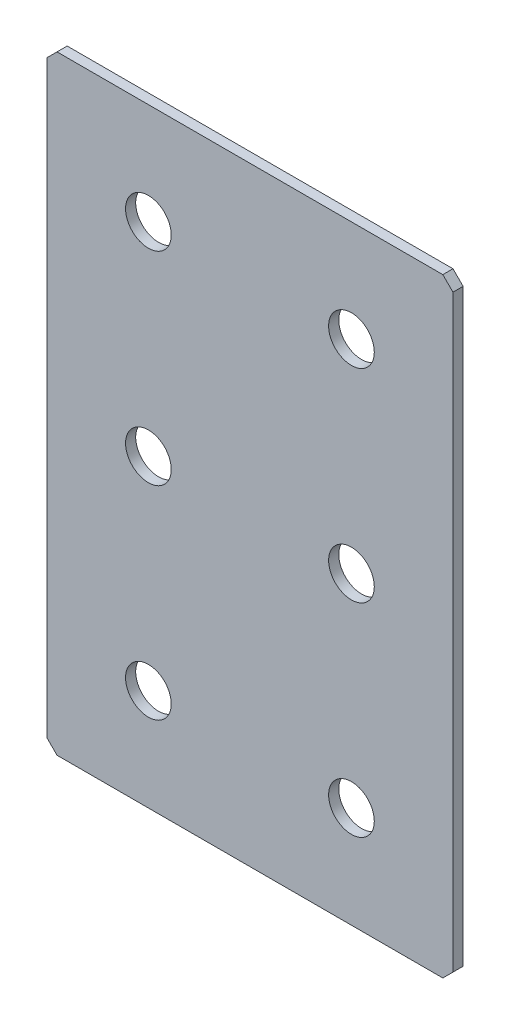
ISO-10303-21;
HEADER;
FILE_DESCRIPTION(('STEP AP214'),'2;1');
FILE_NAME('part.step','',(''),(''),'','','');
FILE_SCHEMA(('AUTOMOTIVE_DESIGN { 1 0 10303 214 1 1 1 1 }'));
ENDSEC;
DATA;
#1=APPLICATION_CONTEXT('core data for automotive mechanical design processes');
#2=APPLICATION_PROTOCOL_DEFINITION('international standard','automotive_design',2000,#1);
#3=PRODUCT_CONTEXT('',#1,'mechanical');
#4=PRODUCT('Part','Part','',(#3));
#5=PRODUCT_RELATED_PRODUCT_CATEGORY('part','',(#4));
#6=PRODUCT_DEFINITION_FORMATION('','',#4);
#7=PRODUCT_DEFINITION_CONTEXT('part definition',#1,'design');
#8=PRODUCT_DEFINITION('design','',#6,#7);
#9=PRODUCT_DEFINITION_SHAPE('','',#8);
#10=(LENGTH_UNIT() NAMED_UNIT(*) SI_UNIT(.MILLI.,.METRE.));
#11=(NAMED_UNIT(*) PLANE_ANGLE_UNIT() SI_UNIT($,.RADIAN.));
#12=(NAMED_UNIT(*) SI_UNIT($,.STERADIAN.) SOLID_ANGLE_UNIT());
#13=UNCERTAINTY_MEASURE_WITH_UNIT(LENGTH_MEASURE(1.E-05),#10,'distance_accuracy_value','');
#14=(GEOMETRIC_REPRESENTATION_CONTEXT(3) GLOBAL_UNCERTAINTY_ASSIGNED_CONTEXT((#13)) GLOBAL_UNIT_ASSIGNED_CONTEXT((#10,
#11,#12)) REPRESENTATION_CONTEXT('',''));
#15=CARTESIAN_POINT('',(0.,0.,0.));
#16=DIRECTION('',(0.,0.,1.));
#17=DIRECTION('',(1.,0.,0.));
#18=AXIS2_PLACEMENT_3D('',#15,#16,#17);
#19=CARTESIAN_POINT('',(40.,-60.,2.));
#20=DIRECTION('',(-1.,0.,0.));
#21=DIRECTION('',(0.,0.,1.));
#22=AXIS2_PLACEMENT_3D('',#19,#20,#21);
#23=PLANE('',#22);
#24=DIRECTION('',(0.,1.,0.));
#25=VECTOR('',#24,1.);
#26=CARTESIAN_POINT('',(40.,-60.,2.));
#27=LINE('',#26,#25);
#28=CARTESIAN_POINT('',(40.,-58.,2.));
#29=VERTEX_POINT('',#28);
#30=CARTESIAN_POINT('',(40.,58.,2.));
#31=VERTEX_POINT('',#30);
#32=EDGE_CURVE('E128',#29,#31,#27,.T.);
#33=ORIENTED_EDGE('',*,*,#32,.F.);
#34=DIRECTION('',(0.,0.,-1.));
#35=VECTOR('',#34,1.);
#36=CARTESIAN_POINT('',(40.,-58.,2.));
#37=LINE('',#36,#35);
#38=CARTESIAN_POINT('',(40.,-58.,0.));
#39=VERTEX_POINT('',#38);
#40=EDGE_CURVE('E154',#29,#39,#37,.T.);
#41=ORIENTED_EDGE('',*,*,#40,.T.);
#42=DIRECTION('',(0.,1.,0.));
#43=VECTOR('',#42,1.);
#44=CARTESIAN_POINT('',(40.,-60.,0.));
#45=LINE('',#44,#43);
#46=CARTESIAN_POINT('',(40.,58.,0.));
#47=VERTEX_POINT('',#46);
#48=EDGE_CURVE('E162',#39,#47,#45,.T.);
#49=ORIENTED_EDGE('',*,*,#48,.T.);
#50=DIRECTION('',(0.,0.,1.));
#51=VECTOR('',#50,1.);
#52=CARTESIAN_POINT('',(40.,58.,2.));
#53=LINE('',#52,#51);
#54=EDGE_CURVE('E152',#47,#31,#53,.T.);
#55=ORIENTED_EDGE('',*,*,#54,.T.);
#56=EDGE_LOOP('',(#33,#41,#49,#55));
#57=FACE_BOUND('',#56,.T.);
#58=ADVANCED_FACE('F37',(#57),#23,.F.);
#59=CARTESIAN_POINT('',(-40.,60.,2.));
#60=DIRECTION('',(0.,-1.,0.));
#61=DIRECTION('',(0.,0.,-1.));
#62=AXIS2_PLACEMENT_3D('',#59,#60,#61);
#63=PLANE('',#62);
#64=DIRECTION('',(-1.,0.,0.));
#65=VECTOR('',#64,1.);
#66=CARTESIAN_POINT('',(-40.,60.,0.));
#67=LINE('',#66,#65);
#68=CARTESIAN_POINT('',(38.,60.,0.));
#69=VERTEX_POINT('',#68);
#70=CARTESIAN_POINT('',(-38.,60.,0.));
#71=VERTEX_POINT('',#70);
#72=EDGE_CURVE('E133',#69,#71,#67,.T.);
#73=ORIENTED_EDGE('',*,*,#72,.T.);
#74=DIRECTION('',(0.,0.,1.));
#75=VECTOR('',#74,1.);
#76=CARTESIAN_POINT('',(-38.,60.,2.));
#77=LINE('',#76,#75);
#78=CARTESIAN_POINT('',(-38.,60.,2.));
#79=VERTEX_POINT('',#78);
#80=EDGE_CURVE('E11',#71,#79,#77,.T.);
#81=ORIENTED_EDGE('',*,*,#80,.T.);
#82=DIRECTION('',(-1.,0.,0.));
#83=VECTOR('',#82,1.);
#84=CARTESIAN_POINT('',(-40.,60.,2.));
#85=LINE('',#84,#83);
#86=CARTESIAN_POINT('',(38.,60.,2.));
#87=VERTEX_POINT('',#86);
#88=EDGE_CURVE('E131',#87,#79,#85,.T.);
#89=ORIENTED_EDGE('',*,*,#88,.F.);
#90=DIRECTION('',(0.,0.,-1.));
#91=VECTOR('',#90,1.);
#92=CARTESIAN_POINT('',(38.,60.,2.));
#93=LINE('',#92,#91);
#94=EDGE_CURVE('E45',#87,#69,#93,.T.);
#95=ORIENTED_EDGE('',*,*,#94,.T.);
#96=EDGE_LOOP('',(#73,#81,#89,#95));
#97=FACE_BOUND('',#96,.T.);
#98=ADVANCED_FACE('F159',(#97),#63,.F.);
#99=CARTESIAN_POINT('',(-40.,-60.,2.));
#100=DIRECTION('',(1.,0.,0.));
#101=DIRECTION('',(0.,0.,-1.));
#102=AXIS2_PLACEMENT_3D('',#99,#100,#101);
#103=PLANE('',#102);
#104=DIRECTION('',(0.,-1.,0.));
#105=VECTOR('',#104,1.);
#106=CARTESIAN_POINT('',(-40.,-60.,0.));
#107=LINE('',#106,#105);
#108=CARTESIAN_POINT('',(-40.,58.,0.));
#109=VERTEX_POINT('',#108);
#110=CARTESIAN_POINT('',(-40.,-58.,0.));
#111=VERTEX_POINT('',#110);
#112=EDGE_CURVE('E129',#109,#111,#107,.T.);
#113=ORIENTED_EDGE('',*,*,#112,.T.);
#114=DIRECTION('',(0.,0.,1.));
#115=VECTOR('',#114,1.);
#116=CARTESIAN_POINT('',(-40.,-58.,2.));
#117=LINE('',#116,#115);
#118=CARTESIAN_POINT('',(-40.,-58.,2.));
#119=VERTEX_POINT('',#118);
#120=EDGE_CURVE('E107',#111,#119,#117,.T.);
#121=ORIENTED_EDGE('',*,*,#120,.T.);
#122=DIRECTION('',(0.,-1.,0.));
#123=VECTOR('',#122,1.);
#124=CARTESIAN_POINT('',(-40.,-60.,2.));
#125=LINE('',#124,#123);
#126=CARTESIAN_POINT('',(-40.,58.,2.));
#127=VERTEX_POINT('',#126);
#128=EDGE_CURVE('E167',#127,#119,#125,.T.);
#129=ORIENTED_EDGE('',*,*,#128,.F.);
#130=DIRECTION('',(0.,0.,-1.));
#131=VECTOR('',#130,1.);
#132=CARTESIAN_POINT('',(-40.,58.,2.));
#133=LINE('',#132,#131);
#134=EDGE_CURVE('E112',#127,#109,#133,.T.);
#135=ORIENTED_EDGE('',*,*,#134,.T.);
#136=EDGE_LOOP('',(#113,#121,#129,#135));
#137=FACE_BOUND('',#136,.T.);
#138=ADVANCED_FACE('F226',(#137),#103,.F.);
#139=CARTESIAN_POINT('',(-40.,-60.,2.));
#140=DIRECTION('',(0.,1.,0.));
#141=DIRECTION('',(0.,0.,1.));
#142=AXIS2_PLACEMENT_3D('',#139,#140,#141);
#143=PLANE('',#142);
#144=DIRECTION('',(1.,0.,0.));
#145=VECTOR('',#144,1.);
#146=CARTESIAN_POINT('',(-40.,-60.,2.));
#147=LINE('',#146,#145);
#148=CARTESIAN_POINT('',(-38.,-60.,2.));
#149=VERTEX_POINT('',#148);
#150=CARTESIAN_POINT('',(38.,-60.,2.));
#151=VERTEX_POINT('',#150);
#152=EDGE_CURVE('E122',#149,#151,#147,.T.);
#153=ORIENTED_EDGE('',*,*,#152,.F.);
#154=DIRECTION('',(0.,0.,-1.));
#155=VECTOR('',#154,1.);
#156=CARTESIAN_POINT('',(-38.,-60.,2.));
#157=LINE('',#156,#155);
#158=CARTESIAN_POINT('',(-38.,-60.,0.));
#159=VERTEX_POINT('',#158);
#160=EDGE_CURVE('E106',#149,#159,#157,.T.);
#161=ORIENTED_EDGE('',*,*,#160,.T.);
#162=DIRECTION('',(1.,0.,0.));
#163=VECTOR('',#162,1.);
#164=CARTESIAN_POINT('',(-40.,-60.,0.));
#165=LINE('',#164,#163);
#166=CARTESIAN_POINT('',(38.,-60.,0.));
#167=VERTEX_POINT('',#166);
#168=EDGE_CURVE('E119',#159,#167,#165,.T.);
#169=ORIENTED_EDGE('',*,*,#168,.T.);
#170=DIRECTION('',(0.,0.,1.));
#171=VECTOR('',#170,1.);
#172=CARTESIAN_POINT('',(38.,-60.,2.));
#173=LINE('',#172,#171);
#174=EDGE_CURVE('E124',#167,#151,#173,.T.);
#175=ORIENTED_EDGE('',*,*,#174,.T.);
#176=EDGE_LOOP('',(#153,#161,#169,#175));
#177=FACE_BOUND('',#176,.T.);
#178=ADVANCED_FACE('F118',(#177),#143,.F.);
#179=CARTESIAN_POINT('',(0.,0.,2.));
#180=DIRECTION('',(0.,0.,-1.));
#181=DIRECTION('',(-1.,0.,0.));
#182=AXIS2_PLACEMENT_3D('',#179,#180,#181);
#183=PLANE('',#182);
#184=CARTESIAN_POINT('',(-20.,40.,2.));
#185=DIRECTION('',(0.,0.,1.));
#186=DIRECTION('',(1.,0.,0.));
#187=AXIS2_PLACEMENT_3D('',#184,#185,#186);
#188=CIRCLE('',#187,4.49999999999999);
#189=CARTESIAN_POINT('',(-15.5,40.,2.));
#190=VERTEX_POINT('',#189);
#191=EDGE_CURVE('E203',#190,#190,#188,.T.);
#192=ORIENTED_EDGE('',*,*,#191,.F.);
#193=EDGE_LOOP('',(#192));
#194=FACE_BOUND('',#193,.T.);
#195=CARTESIAN_POINT('',(20.,40.,2.));
#196=DIRECTION('',(0.,0.,1.));
#197=DIRECTION('',(1.,0.,0.));
#198=AXIS2_PLACEMENT_3D('',#195,#196,#197);
#199=CIRCLE('',#198,4.49999999999999);
#200=CARTESIAN_POINT('',(24.5,40.,2.));
#201=VERTEX_POINT('',#200);
#202=EDGE_CURVE('E197',#201,#201,#199,.T.);
#203=ORIENTED_EDGE('',*,*,#202,.F.);
#204=EDGE_LOOP('',(#203));
#205=FACE_BOUND('',#204,.T.);
#206=CARTESIAN_POINT('',(20.,0.,2.));
#207=DIRECTION('',(0.,0.,1.));
#208=DIRECTION('',(1.,0.,0.));
#209=AXIS2_PLACEMENT_3D('',#206,#207,#208);
#210=CIRCLE('',#209,4.49999999999999);
#211=CARTESIAN_POINT('',(24.5,0.,2.));
#212=VERTEX_POINT('',#211);
#213=EDGE_CURVE('E191',#212,#212,#210,.T.);
#214=ORIENTED_EDGE('',*,*,#213,.F.);
#215=EDGE_LOOP('',(#214));
#216=FACE_BOUND('',#215,.T.);
#217=CARTESIAN_POINT('',(-20.,0.,2.));
#218=DIRECTION('',(0.,0.,1.));
#219=DIRECTION('',(1.,0.,0.));
#220=AXIS2_PLACEMENT_3D('',#217,#218,#219);
#221=CIRCLE('',#220,4.49999999999999);
#222=CARTESIAN_POINT('',(-15.5,0.,2.));
#223=VERTEX_POINT('',#222);
#224=EDGE_CURVE('E185',#223,#223,#221,.T.);
#225=ORIENTED_EDGE('',*,*,#224,.F.);
#226=EDGE_LOOP('',(#225));
#227=FACE_BOUND('',#226,.T.);
#228=CARTESIAN_POINT('',(-20.,-40.,2.));
#229=DIRECTION('',(0.,0.,1.));
#230=DIRECTION('',(1.,0.,0.));
#231=AXIS2_PLACEMENT_3D('',#228,#229,#230);
#232=CIRCLE('',#231,4.49999999999999);
#233=CARTESIAN_POINT('',(-15.5,-40.,2.));
#234=VERTEX_POINT('',#233);
#235=EDGE_CURVE('E179',#234,#234,#232,.T.);
#236=ORIENTED_EDGE('',*,*,#235,.F.);
#237=EDGE_LOOP('',(#236));
#238=FACE_BOUND('',#237,.T.);
#239=CARTESIAN_POINT('',(20.,-40.,2.));
#240=DIRECTION('',(0.,0.,1.));
#241=DIRECTION('',(1.,0.,0.));
#242=AXIS2_PLACEMENT_3D('',#239,#240,#241);
#243=CIRCLE('',#242,4.49999999999999);
#244=CARTESIAN_POINT('',(24.5,-40.,2.));
#245=VERTEX_POINT('',#244);
#246=EDGE_CURVE('E173',#245,#245,#243,.T.);
#247=ORIENTED_EDGE('',*,*,#246,.F.);
#248=EDGE_LOOP('',(#247));
#249=FACE_BOUND('',#248,.T.);
#250=ORIENTED_EDGE('',*,*,#128,.T.);
#251=DIRECTION('',(-0.707106781186548,0.707106781186548,0.));
#252=VECTOR('',#251,1.);
#253=CARTESIAN_POINT('',(-38.,-60.,2.));
#254=LINE('',#253,#252);
#255=EDGE_CURVE('E150',#119,#149,#254,.F.);
#256=ORIENTED_EDGE('',*,*,#255,.T.);
#257=ORIENTED_EDGE('',*,*,#152,.T.);
#258=DIRECTION('',(-0.707106781186548,-0.707106781186548,0.));
#259=VECTOR('',#258,1.);
#260=CARTESIAN_POINT('',(40.,-58.,2.));
#261=LINE('',#260,#259);
#262=EDGE_CURVE('E148',#151,#29,#261,.F.);
#263=ORIENTED_EDGE('',*,*,#262,.T.);
#264=ORIENTED_EDGE('',*,*,#32,.T.);
#265=DIRECTION('',(0.707106781186549,-0.707106781186546,0.));
#266=VECTOR('',#265,1.);
#267=CARTESIAN_POINT('',(38.,60.,2.));
#268=LINE('',#267,#266);
#269=EDGE_CURVE('E57',#31,#87,#268,.F.);
#270=ORIENTED_EDGE('',*,*,#269,.T.);
#271=ORIENTED_EDGE('',*,*,#88,.T.);
#272=DIRECTION('',(0.707106781186551,0.707106781186544,0.));
#273=VECTOR('',#272,1.);
#274=CARTESIAN_POINT('',(-40.,58.,2.));
#275=LINE('',#274,#273);
#276=EDGE_CURVE('E146',#79,#127,#275,.F.);
#277=ORIENTED_EDGE('',*,*,#276,.T.);
#278=EDGE_LOOP('',(#250,#256,#257,#263,#264,#270,#271,#277));
#279=FACE_BOUND('',#278,.T.);
#280=ADVANCED_FACE('F209',(#194,#205,#216,#227,#238,#249,#279),#183,.F.);
#281=CARTESIAN_POINT('',(0.,0.,0.));
#282=DIRECTION('',(0.,0.,-1.));
#283=DIRECTION('',(-1.,0.,0.));
#284=AXIS2_PLACEMENT_3D('',#281,#282,#283);
#285=PLANE('',#284);
#286=CARTESIAN_POINT('',(-20.,40.,0.));
#287=DIRECTION('',(0.,0.,1.));
#288=DIRECTION('',(1.,0.,0.));
#289=AXIS2_PLACEMENT_3D('',#286,#287,#288);
#290=CIRCLE('',#289,4.49999999999999);
#291=CARTESIAN_POINT('',(-15.5,40.,0.));
#292=VERTEX_POINT('',#291);
#293=EDGE_CURVE('E200',#292,#292,#290,.T.);
#294=ORIENTED_EDGE('',*,*,#293,.T.);
#295=EDGE_LOOP('',(#294));
#296=FACE_BOUND('',#295,.T.);
#297=CARTESIAN_POINT('',(20.,40.,0.));
#298=DIRECTION('',(0.,0.,1.));
#299=DIRECTION('',(1.,0.,0.));
#300=AXIS2_PLACEMENT_3D('',#297,#298,#299);
#301=CIRCLE('',#300,4.49999999999999);
#302=CARTESIAN_POINT('',(24.5,40.,0.));
#303=VERTEX_POINT('',#302);
#304=EDGE_CURVE('E194',#303,#303,#301,.T.);
#305=ORIENTED_EDGE('',*,*,#304,.T.);
#306=EDGE_LOOP('',(#305));
#307=FACE_BOUND('',#306,.T.);
#308=CARTESIAN_POINT('',(20.,0.,0.));
#309=DIRECTION('',(0.,0.,1.));
#310=DIRECTION('',(1.,0.,0.));
#311=AXIS2_PLACEMENT_3D('',#308,#309,#310);
#312=CIRCLE('',#311,4.49999999999999);
#313=CARTESIAN_POINT('',(24.5,0.,0.));
#314=VERTEX_POINT('',#313);
#315=EDGE_CURVE('E188',#314,#314,#312,.T.);
#316=ORIENTED_EDGE('',*,*,#315,.T.);
#317=EDGE_LOOP('',(#316));
#318=FACE_BOUND('',#317,.T.);
#319=CARTESIAN_POINT('',(-20.,0.,0.));
#320=DIRECTION('',(0.,0.,1.));
#321=DIRECTION('',(1.,0.,0.));
#322=AXIS2_PLACEMENT_3D('',#319,#320,#321);
#323=CIRCLE('',#322,4.49999999999999);
#324=CARTESIAN_POINT('',(-15.5,0.,0.));
#325=VERTEX_POINT('',#324);
#326=EDGE_CURVE('E182',#325,#325,#323,.T.);
#327=ORIENTED_EDGE('',*,*,#326,.T.);
#328=EDGE_LOOP('',(#327));
#329=FACE_BOUND('',#328,.T.);
#330=CARTESIAN_POINT('',(-20.,-40.,0.));
#331=DIRECTION('',(0.,0.,1.));
#332=DIRECTION('',(1.,0.,0.));
#333=AXIS2_PLACEMENT_3D('',#330,#331,#332);
#334=CIRCLE('',#333,4.49999999999999);
#335=CARTESIAN_POINT('',(-15.5,-40.,0.));
#336=VERTEX_POINT('',#335);
#337=EDGE_CURVE('E176',#336,#336,#334,.T.);
#338=ORIENTED_EDGE('',*,*,#337,.T.);
#339=EDGE_LOOP('',(#338));
#340=FACE_BOUND('',#339,.T.);
#341=CARTESIAN_POINT('',(20.,-40.,0.));
#342=DIRECTION('',(0.,0.,1.));
#343=DIRECTION('',(1.,0.,0.));
#344=AXIS2_PLACEMENT_3D('',#341,#342,#343);
#345=CIRCLE('',#344,4.49999999999999);
#346=CARTESIAN_POINT('',(24.5,-40.,0.));
#347=VERTEX_POINT('',#346);
#348=EDGE_CURVE('E163',#347,#347,#345,.T.);
#349=ORIENTED_EDGE('',*,*,#348,.T.);
#350=EDGE_LOOP('',(#349));
#351=FACE_BOUND('',#350,.T.);
#352=ORIENTED_EDGE('',*,*,#168,.F.);
#353=DIRECTION('',(0.707106781186548,-0.707106781186548,0.));
#354=VECTOR('',#353,1.);
#355=CARTESIAN_POINT('',(-49.,-49.,0.));
#356=LINE('',#355,#354);
#357=EDGE_CURVE('E102',#159,#111,#356,.F.);
#358=ORIENTED_EDGE('',*,*,#357,.T.);
#359=ORIENTED_EDGE('',*,*,#112,.F.);
#360=DIRECTION('',(-0.707106781186551,-0.707106781186544,0.));
#361=VECTOR('',#360,1.);
#362=CARTESIAN_POINT('',(-48.9999999999998,49.0000000000003,0.));
#363=LINE('',#362,#361);
#364=EDGE_CURVE('E139',#109,#71,#363,.F.);
#365=ORIENTED_EDGE('',*,*,#364,.T.);
#366=ORIENTED_EDGE('',*,*,#72,.F.);
#367=DIRECTION('',(-0.707106781186549,0.707106781186546,0.));
#368=VECTOR('',#367,1.);
#369=CARTESIAN_POINT('',(48.9999999999999,49.0000000000001,0.));
#370=LINE('',#369,#368);
#371=EDGE_CURVE('E123',#69,#47,#370,.F.);
#372=ORIENTED_EDGE('',*,*,#371,.T.);
#373=ORIENTED_EDGE('',*,*,#48,.F.);
#374=DIRECTION('',(0.707106781186548,0.707106781186548,0.));
#375=VECTOR('',#374,1.);
#376=CARTESIAN_POINT('',(49.,-49.,0.));
#377=LINE('',#376,#375);
#378=EDGE_CURVE('E113',#39,#167,#377,.F.);
#379=ORIENTED_EDGE('',*,*,#378,.T.);
#380=EDGE_LOOP('',(#352,#358,#359,#365,#366,#372,#373,#379));
#381=FACE_BOUND('',#380,.T.);
#382=ADVANCED_FACE('F126',(#296,#307,#318,#329,#340,#351,#381),#285,.T.);
#383=CARTESIAN_POINT('',(-38.,-60.,2.));
#384=DIRECTION('',(0.707106781186547,0.707106781186547,0.));
#385=DIRECTION('',(0.,0.,-1.));
#386=AXIS2_PLACEMENT_3D('',#383,#384,#385);
#387=PLANE('',#386);
#388=ORIENTED_EDGE('',*,*,#255,.F.);
#389=ORIENTED_EDGE('',*,*,#120,.F.);
#390=ORIENTED_EDGE('',*,*,#357,.F.);
#391=ORIENTED_EDGE('',*,*,#160,.F.);
#392=EDGE_LOOP('',(#388,#389,#390,#391));
#393=FACE_BOUND('',#392,.T.);
#394=ADVANCED_FACE('F105',(#393),#387,.F.);
#395=CARTESIAN_POINT('',(40.,-58.,2.));
#396=DIRECTION('',(-0.707106781186547,0.707106781186547,0.));
#397=DIRECTION('',(0.,0.,-1.));
#398=AXIS2_PLACEMENT_3D('',#395,#396,#397);
#399=PLANE('',#398);
#400=ORIENTED_EDGE('',*,*,#262,.F.);
#401=ORIENTED_EDGE('',*,*,#174,.F.);
#402=ORIENTED_EDGE('',*,*,#378,.F.);
#403=ORIENTED_EDGE('',*,*,#40,.F.);
#404=EDGE_LOOP('',(#400,#401,#402,#403));
#405=FACE_BOUND('',#404,.T.);
#406=ADVANCED_FACE('F230',(#405),#399,.F.);
#407=CARTESIAN_POINT('',(-40.,58.,2.));
#408=DIRECTION('',(0.707106781186544,-0.707106781186551,0.));
#409=DIRECTION('',(0.,0.,-1.));
#410=AXIS2_PLACEMENT_3D('',#407,#408,#409);
#411=PLANE('',#410);
#412=ORIENTED_EDGE('',*,*,#276,.F.);
#413=ORIENTED_EDGE('',*,*,#80,.F.);
#414=ORIENTED_EDGE('',*,*,#364,.F.);
#415=ORIENTED_EDGE('',*,*,#134,.F.);
#416=EDGE_LOOP('',(#412,#413,#414,#415));
#417=FACE_BOUND('',#416,.T.);
#418=ADVANCED_FACE('F228',(#417),#411,.F.);
#419=CARTESIAN_POINT('',(38.,60.,2.));
#420=DIRECTION('',(-0.707106781186546,-0.707106781186549,0.));
#421=DIRECTION('',(0.,0.,-1.));
#422=AXIS2_PLACEMENT_3D('',#419,#420,#421);
#423=PLANE('',#422);
#424=ORIENTED_EDGE('',*,*,#269,.F.);
#425=ORIENTED_EDGE('',*,*,#54,.F.);
#426=ORIENTED_EDGE('',*,*,#371,.F.);
#427=ORIENTED_EDGE('',*,*,#94,.F.);
#428=EDGE_LOOP('',(#424,#425,#426,#427));
#429=FACE_BOUND('',#428,.T.);
#430=ADVANCED_FACE('F39',(#429),#423,.F.);
#431=CARTESIAN_POINT('',(20.,-40.,2.));
#432=DIRECTION('',(0.,0.,1.));
#433=DIRECTION('',(1.,0.,0.));
#434=AXIS2_PLACEMENT_3D('',#431,#432,#433);
#435=CYLINDRICAL_SURFACE('',#434,4.49999999999999);
#436=ORIENTED_EDGE('',*,*,#348,.F.);
#437=EDGE_LOOP('',(#436));
#438=FACE_BOUND('',#437,.T.);
#439=ORIENTED_EDGE('',*,*,#246,.T.);
#440=EDGE_LOOP('',(#439));
#441=FACE_BOUND('',#440,.T.);
#442=ADVANCED_FACE('F235',(#438,#441),#435,.F.);
#443=CARTESIAN_POINT('',(-20.,-40.,2.));
#444=DIRECTION('',(0.,0.,1.));
#445=DIRECTION('',(1.,0.,0.));
#446=AXIS2_PLACEMENT_3D('',#443,#444,#445);
#447=CYLINDRICAL_SURFACE('',#446,4.49999999999999);
#448=ORIENTED_EDGE('',*,*,#337,.F.);
#449=EDGE_LOOP('',(#448));
#450=FACE_BOUND('',#449,.T.);
#451=ORIENTED_EDGE('',*,*,#235,.T.);
#452=EDGE_LOOP('',(#451));
#453=FACE_BOUND('',#452,.T.);
#454=ADVANCED_FACE('F290',(#450,#453),#447,.F.);
#455=CARTESIAN_POINT('',(-20.,0.,2.));
#456=DIRECTION('',(0.,0.,1.));
#457=DIRECTION('',(1.,0.,0.));
#458=AXIS2_PLACEMENT_3D('',#455,#456,#457);
#459=CYLINDRICAL_SURFACE('',#458,4.49999999999999);
#460=ORIENTED_EDGE('',*,*,#326,.F.);
#461=EDGE_LOOP('',(#460));
#462=FACE_BOUND('',#461,.T.);
#463=ORIENTED_EDGE('',*,*,#224,.T.);
#464=EDGE_LOOP('',(#463));
#465=FACE_BOUND('',#464,.T.);
#466=ADVANCED_FACE('F299',(#462,#465),#459,.F.);
#467=CARTESIAN_POINT('',(20.,0.,2.));
#468=DIRECTION('',(0.,0.,1.));
#469=DIRECTION('',(1.,0.,0.));
#470=AXIS2_PLACEMENT_3D('',#467,#468,#469);
#471=CYLINDRICAL_SURFACE('',#470,4.49999999999999);
#472=ORIENTED_EDGE('',*,*,#315,.F.);
#473=EDGE_LOOP('',(#472));
#474=FACE_BOUND('',#473,.T.);
#475=ORIENTED_EDGE('',*,*,#213,.T.);
#476=EDGE_LOOP('',(#475));
#477=FACE_BOUND('',#476,.T.);
#478=ADVANCED_FACE('F309',(#474,#477),#471,.F.);
#479=CARTESIAN_POINT('',(20.,40.,2.));
#480=DIRECTION('',(0.,0.,1.));
#481=DIRECTION('',(1.,0.,0.));
#482=AXIS2_PLACEMENT_3D('',#479,#480,#481);
#483=CYLINDRICAL_SURFACE('',#482,4.49999999999999);
#484=ORIENTED_EDGE('',*,*,#304,.F.);
#485=EDGE_LOOP('',(#484));
#486=FACE_BOUND('',#485,.T.);
#487=ORIENTED_EDGE('',*,*,#202,.T.);
#488=EDGE_LOOP('',(#487));
#489=FACE_BOUND('',#488,.T.);
#490=ADVANCED_FACE('F319',(#486,#489),#483,.F.);
#491=CARTESIAN_POINT('',(-20.,40.,2.));
#492=DIRECTION('',(0.,0.,1.));
#493=DIRECTION('',(1.,0.,0.));
#494=AXIS2_PLACEMENT_3D('',#491,#492,#493);
#495=CYLINDRICAL_SURFACE('',#494,4.49999999999999);
#496=ORIENTED_EDGE('',*,*,#293,.F.);
#497=EDGE_LOOP('',(#496));
#498=FACE_BOUND('',#497,.T.);
#499=ORIENTED_EDGE('',*,*,#191,.T.);
#500=EDGE_LOOP('',(#499));
#501=FACE_BOUND('',#500,.T.);
#502=ADVANCED_FACE('F207',(#498,#501),#495,.F.);
#503=CLOSED_SHELL('',(#58,#98,#138,#178,#280,#382,#394,#406,#418,#430,#442,#454,#466,#478,#490,#502));
#504=MANIFOLD_SOLID_BREP('B2',#503);
#505=ADVANCED_BREP_SHAPE_REPRESENTATION('',(#18,#504),#14);
#506=SHAPE_DEFINITION_REPRESENTATION(#9,#505);
ENDSEC;
END-ISO-10303-21;
